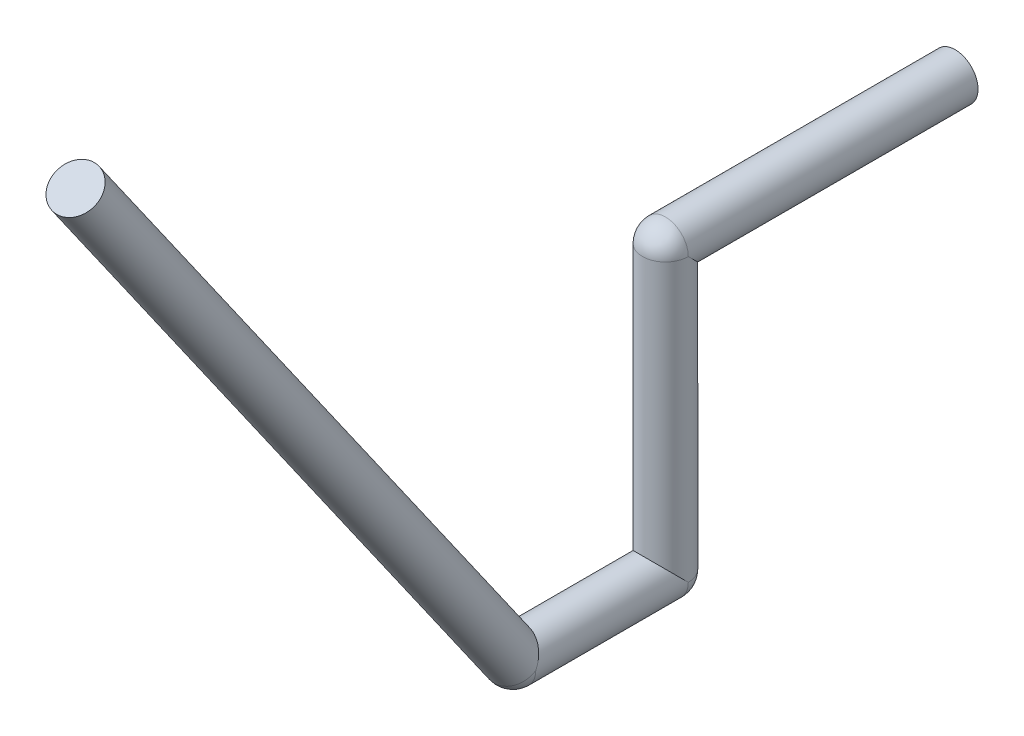
ISO-10303-21;
HEADER;
FILE_DESCRIPTION(('STEP AP214'),'2;1');
FILE_NAME('part.step','',(''),(''),'','','');
FILE_SCHEMA(('AUTOMOTIVE_DESIGN { 1 0 10303 214 1 1 1 1 }'));
ENDSEC;
DATA;
#1=APPLICATION_CONTEXT('core data for automotive mechanical design processes');
#2=APPLICATION_PROTOCOL_DEFINITION('international standard','automotive_design',2000,#1);
#3=PRODUCT_CONTEXT('',#1,'mechanical');
#4=PRODUCT('Part','Part','',(#3));
#5=PRODUCT_RELATED_PRODUCT_CATEGORY('part','',(#4));
#6=PRODUCT_DEFINITION_FORMATION('','',#4);
#7=PRODUCT_DEFINITION_CONTEXT('part definition',#1,'design');
#8=PRODUCT_DEFINITION('design','',#6,#7);
#9=PRODUCT_DEFINITION_SHAPE('','',#8);
#10=(LENGTH_UNIT() NAMED_UNIT(*) SI_UNIT(.MILLI.,.METRE.));
#11=(NAMED_UNIT(*) PLANE_ANGLE_UNIT() SI_UNIT($,.RADIAN.));
#12=(NAMED_UNIT(*) SI_UNIT($,.STERADIAN.) SOLID_ANGLE_UNIT());
#13=UNCERTAINTY_MEASURE_WITH_UNIT(LENGTH_MEASURE(1.E-05),#10,'distance_accuracy_value','');
#14=(GEOMETRIC_REPRESENTATION_CONTEXT(3) GLOBAL_UNCERTAINTY_ASSIGNED_CONTEXT((#13)) GLOBAL_UNIT_ASSIGNED_CONTEXT((#10,
#11,#12)) REPRESENTATION_CONTEXT('',''));
#15=CARTESIAN_POINT('',(0.,0.,0.));
#16=DIRECTION('',(0.,0.,1.));
#17=DIRECTION('',(1.,0.,0.));
#18=AXIS2_PLACEMENT_3D('',#15,#16,#17);
#19=CARTESIAN_POINT('',(1.8,12.49152044289,9.03576436351));
#20=DIRECTION('',(0.,0.819152044289016,0.573576436351011));
#21=DIRECTION('',(1.,0.,0.));
#22=AXIS2_PLACEMENT_3D('',#19,#20,#21);
#23=PLANE('',#22);
#24=CARTESIAN_POINT('',(1.8,12.49152044289,9.03576436351));
#25=DIRECTION('',(0.,0.819152044289016,0.573576436351011));
#26=DIRECTION('',(1.,0.,0.));
#27=AXIS2_PLACEMENT_3D('',#24,#25,#26);
#28=CIRCLE('',#27,0.3);
#29=CARTESIAN_POINT('',(1.5,12.49152044289,9.03576436351));
#30=VERTEX_POINT('',#29);
#31=EDGE_CURVE('E20',#30,#30,#28,.T.);
#32=ORIENTED_EDGE('',*,*,#31,.T.);
#33=EDGE_LOOP('',(#32));
#34=FACE_BOUND('',#33,.T.);
#35=ADVANCED_FACE('F17',(#34),#23,.T.);
#36=CARTESIAN_POINT('',(1.8,4.3,3.3));
#37=DIRECTION('',(0.,0.,1.));
#38=DIRECTION('',(1.,0.,0.));
#39=AXIS2_PLACEMENT_3D('',#36,#37,#38);
#40=SPHERICAL_SURFACE('',#39,0.3);
#41=CARTESIAN_POINT('',(1.8,4.3,3.3));
#42=DIRECTION('',(0.,0.,1.));
#43=DIRECTION('',(1.,0.,0.));
#44=AXIS2_PLACEMENT_3D('',#41,#42,#43);
#45=CIRCLE('',#44,0.3);
#46=CARTESIAN_POINT('',(1.5,4.3,3.3));
#47=VERTEX_POINT('',#46);
#48=CARTESIAN_POINT('',(2.1,4.3,3.3));
#49=VERTEX_POINT('',#48);
#50=EDGE_CURVE('E119',#47,#49,#45,.T.);
#51=ORIENTED_EDGE('',*,*,#50,.T.);
#52=CARTESIAN_POINT('',(1.8,4.3,3.3));
#53=DIRECTION('',(0.,0.819152044289016,0.573576436351011));
#54=DIRECTION('',(1.,0.,0.));
#55=AXIS2_PLACEMENT_3D('',#52,#53,#54);
#56=CIRCLE('',#55,0.3);
#57=EDGE_CURVE('E11',#47,#49,#56,.T.);
#58=ORIENTED_EDGE('',*,*,#57,.F.);
#59=EDGE_LOOP('',(#51,#58));
#60=FACE_BOUND('',#59,.T.);
#61=ADVANCED_FACE('F169',(#60),#40,.T.);
#62=CARTESIAN_POINT('',(1.8,4.3,3.3));
#63=DIRECTION('',(0.,0.819152044289016,0.573576436351011));
#64=DIRECTION('',(1.,0.,0.));
#65=AXIS2_PLACEMENT_3D('',#62,#63,#64);
#66=CYLINDRICAL_SURFACE('',#65,0.3);
#67=ORIENTED_EDGE('',*,*,#31,.F.);
#68=DIRECTION('',(0.,-0.819152044289016,-0.573576436351011));
#69=VECTOR('',#68,1.);
#70=CARTESIAN_POINT('',(1.5,4.3,3.3));
#71=LINE('',#70,#69);
#72=EDGE_CURVE('E27',#30,#47,#71,.T.);
#73=ORIENTED_EDGE('',*,*,#72,.T.);
#74=ORIENTED_EDGE('',*,*,#57,.T.);
#75=CARTESIAN_POINT('',(1.8,4.3,3.3));
#76=DIRECTION('',(0.,0.461748613235098,0.887010833178188));
#77=DIRECTION('',(0.,0.887010833178188,-0.461748613235098));
#78=AXIS2_PLACEMENT_3D('',#75,#76,#77);
#79=ELLIPSE('',#78,0.33821458406,0.3);
#80=EDGE_CURVE('E137',#49,#47,#79,.T.);
#81=ORIENTED_EDGE('',*,*,#80,.T.);
#82=ORIENTED_EDGE('',*,*,#72,.F.);
#83=EDGE_LOOP('',(#67,#73,#74,#81,#82));
#84=FACE_BOUND('',#83,.T.);
#85=ADVANCED_FACE('F162',(#84),#66,.T.);
#86=CARTESIAN_POINT('',(1.8,4.3,1.3));
#87=DIRECTION('',(0.577350269189626,0.577350269189626,0.577350269189626));
#88=DIRECTION('',(-0.707106781186548,0.,0.707106781186548));
#89=AXIS2_PLACEMENT_3D('',#86,#87,#88);
#90=SPHERICAL_SURFACE('',#89,0.3);
#91=CARTESIAN_POINT('',(1.8,4.3,1.3));
#92=DIRECTION('',(0.,-1.,0.));
#93=DIRECTION('',(1.,0.,0.));
#94=AXIS2_PLACEMENT_3D('',#91,#92,#93);
#95=CIRCLE('',#94,0.3);
#96=CARTESIAN_POINT('',(1.5,4.3,1.3));
#97=VERTEX_POINT('',#96);
#98=CARTESIAN_POINT('',(2.01213203435596,4.3,1.08786796564404));
#99=VERTEX_POINT('',#98);
#100=EDGE_CURVE('E89',#97,#99,#95,.T.);
#101=ORIENTED_EDGE('',*,*,#100,.T.);
#102=CARTESIAN_POINT('',(1.8,4.3,1.3));
#103=DIRECTION('',(-0.408248290463863,0.816496580927726,-0.408248290463863));
#104=DIRECTION('',(0.707106781186548,0.,-0.707106781186548));
#105=AXIS2_PLACEMENT_3D('',#102,#103,#104);
#106=CIRCLE('',#105,0.3);
#107=CARTESIAN_POINT('',(1.62679491924311,4.12679491924311,1.12679491924311));
#108=VERTEX_POINT('',#107);
#109=EDGE_CURVE('E134',#99,#108,#106,.T.);
#110=ORIENTED_EDGE('',*,*,#109,.T.);
#111=ORIENTED_EDGE('',*,*,#109,.F.);
#112=CARTESIAN_POINT('',(1.8,4.3,1.3));
#113=DIRECTION('',(0.,-1.,0.));
#114=DIRECTION('',(1.,0.,0.));
#115=AXIS2_PLACEMENT_3D('',#112,#113,#114);
#116=CIRCLE('',#115,0.3);
#117=CARTESIAN_POINT('',(2.1,4.3,1.3));
#118=VERTEX_POINT('',#117);
#119=EDGE_CURVE('E123',#99,#118,#116,.T.);
#120=ORIENTED_EDGE('',*,*,#119,.T.);
#121=CARTESIAN_POINT('',(1.8,4.3,1.3));
#122=DIRECTION('',(0.,0.,1.));
#123=DIRECTION('',(1.,0.,0.));
#124=AXIS2_PLACEMENT_3D('',#121,#122,#123);
#125=CIRCLE('',#124,0.3);
#126=EDGE_CURVE('E153',#97,#118,#125,.T.);
#127=ORIENTED_EDGE('',*,*,#126,.F.);
#128=EDGE_LOOP('',(#101,#110,#111,#120,#127));
#129=FACE_BOUND('',#128,.T.);
#130=ADVANCED_FACE('F237',(#129),#90,.T.);
#131=CARTESIAN_POINT('',(1.8,4.3,1.3));
#132=DIRECTION('',(0.,0.,1.));
#133=DIRECTION('',(1.,0.,0.));
#134=AXIS2_PLACEMENT_3D('',#131,#132,#133);
#135=CYLINDRICAL_SURFACE('',#134,0.3);
#136=ORIENTED_EDGE('',*,*,#50,.F.);
#137=DIRECTION('',(0.,0.,-1.));
#138=VECTOR('',#137,1.);
#139=CARTESIAN_POINT('',(1.5,4.3,1.3));
#140=LINE('',#139,#138);
#141=EDGE_CURVE('E113',#47,#97,#140,.T.);
#142=ORIENTED_EDGE('',*,*,#141,.T.);
#143=ORIENTED_EDGE('',*,*,#126,.T.);
#144=CARTESIAN_POINT('',(1.8,4.3,1.3));
#145=DIRECTION('',(0.,-0.707106781186548,0.707106781186548));
#146=DIRECTION('',(0.,-0.707106781186548,-0.707106781186548));
#147=AXIS2_PLACEMENT_3D('',#144,#145,#146);
#148=ELLIPSE('',#147,0.424264068712,0.3);
#149=EDGE_CURVE('E127',#118,#97,#148,.T.);
#150=ORIENTED_EDGE('',*,*,#149,.T.);
#151=ORIENTED_EDGE('',*,*,#141,.F.);
#152=ORIENTED_EDGE('',*,*,#80,.F.);
#153=EDGE_LOOP('',(#136,#142,#143,#150,#151,#152));
#154=FACE_BOUND('',#153,.T.);
#155=ADVANCED_FACE('F166',(#154),#135,.T.);
#156=CARTESIAN_POINT('',(1.8,8.,1.3));
#157=DIRECTION('',(0.,-1.,0.));
#158=DIRECTION('',(1.,0.,0.));
#159=AXIS2_PLACEMENT_3D('',#156,#157,#158);
#160=CYLINDRICAL_SURFACE('',#159,0.3);
#161=ORIENTED_EDGE('',*,*,#100,.F.);
#162=DIRECTION('',(0.,1.,0.));
#163=VECTOR('',#162,1.);
#164=CARTESIAN_POINT('',(1.5,8.,1.3));
#165=LINE('',#164,#163);
#166=CARTESIAN_POINT('',(1.5,8.,1.3));
#167=VERTEX_POINT('',#166);
#168=EDGE_CURVE('E118',#97,#167,#165,.T.);
#169=ORIENTED_EDGE('',*,*,#168,.T.);
#170=CARTESIAN_POINT('',(1.8,8.,1.3));
#171=DIRECTION('',(0.,-0.707106781186548,0.707106781186548));
#172=DIRECTION('',(0.,0.707106781186548,0.707106781186548));
#173=AXIS2_PLACEMENT_3D('',#170,#171,#172);
#174=ELLIPSE('',#173,0.424264068712,0.3);
#175=CARTESIAN_POINT('',(2.1,8.,1.3));
#176=VERTEX_POINT('',#175);
#177=EDGE_CURVE('E109',#167,#176,#174,.T.);
#178=ORIENTED_EDGE('',*,*,#177,.T.);
#179=CARTESIAN_POINT('',(1.8,8.,1.3));
#180=DIRECTION('',(0.,-1.,0.));
#181=DIRECTION('',(1.,0.,0.));
#182=AXIS2_PLACEMENT_3D('',#179,#180,#181);
#183=CIRCLE('',#182,0.3);
#184=EDGE_CURVE('E90',#176,#167,#183,.T.);
#185=ORIENTED_EDGE('',*,*,#184,.T.);
#186=ORIENTED_EDGE('',*,*,#168,.F.);
#187=ORIENTED_EDGE('',*,*,#149,.F.);
#188=ORIENTED_EDGE('',*,*,#119,.F.);
#189=EDGE_LOOP('',(#161,#169,#178,#185,#186,#187,#188));
#190=FACE_BOUND('',#189,.T.);
#191=ADVANCED_FACE('F145',(#190),#160,.T.);
#192=CARTESIAN_POINT('',(1.8,8.,1.3));
#193=DIRECTION('',(0.577350269189625,0.577350269189628,0.577350269189625));
#194=DIRECTION('',(-0.707106781186548,0.,0.707106781186548));
#195=AXIS2_PLACEMENT_3D('',#192,#193,#194);
#196=SPHERICAL_SURFACE('',#195,0.3);
#197=ORIENTED_EDGE('',*,*,#184,.F.);
#198=CARTESIAN_POINT('',(1.8,8.,1.3));
#199=DIRECTION('',(0.,0.,1.));
#200=DIRECTION('',(1.,0.,0.));
#201=AXIS2_PLACEMENT_3D('',#198,#199,#200);
#202=CIRCLE('',#201,0.3);
#203=CARTESIAN_POINT('',(2.06832815729997,8.13416407864999,1.3));
#204=VERTEX_POINT('',#203);
#205=EDGE_CURVE('E93',#176,#204,#202,.T.);
#206=ORIENTED_EDGE('',*,*,#205,.T.);
#207=CARTESIAN_POINT('',(1.8,8.,1.3));
#208=DIRECTION('',(-0.408248290463863,0.816496580927726,-0.408248290463863));
#209=DIRECTION('',(0.707106781186548,0.,-0.707106781186548));
#210=AXIS2_PLACEMENT_3D('',#207,#208,#209);
#211=CIRCLE('',#210,0.3);
#212=CARTESIAN_POINT('',(1.97320508075689,8.17320508075689,1.47320508075689));
#213=VERTEX_POINT('',#212);
#214=EDGE_CURVE('E82',#213,#204,#211,.T.);
#215=ORIENTED_EDGE('',*,*,#214,.F.);
#216=ORIENTED_EDGE('',*,*,#214,.T.);
#217=CARTESIAN_POINT('',(1.8,8.,1.3));
#218=DIRECTION('',(0.,0.,1.));
#219=DIRECTION('',(1.,0.,0.));
#220=AXIS2_PLACEMENT_3D('',#217,#218,#219);
#221=CIRCLE('',#220,0.3);
#222=EDGE_CURVE('E86',#204,#167,#221,.T.);
#223=ORIENTED_EDGE('',*,*,#222,.T.);
#224=EDGE_LOOP('',(#197,#206,#215,#216,#223));
#225=FACE_BOUND('',#224,.T.);
#226=ADVANCED_FACE('F84',(#225),#196,.T.);
#227=CARTESIAN_POINT('',(1.8,8.,-2.5));
#228=DIRECTION('',(0.,0.,1.));
#229=DIRECTION('',(1.,0.,0.));
#230=AXIS2_PLACEMENT_3D('',#227,#228,#229);
#231=CYLINDRICAL_SURFACE('',#230,0.3);
#232=ORIENTED_EDGE('',*,*,#177,.F.);
#233=DIRECTION('',(0.,0.,-1.));
#234=VECTOR('',#233,1.);
#235=CARTESIAN_POINT('',(1.5,8.,-2.5));
#236=LINE('',#235,#234);
#237=CARTESIAN_POINT('',(1.5,8.,-2.5));
#238=VERTEX_POINT('',#237);
#239=EDGE_CURVE('E102',#167,#238,#236,.T.);
#240=ORIENTED_EDGE('',*,*,#239,.T.);
#241=CARTESIAN_POINT('',(1.8,8.,-2.5));
#242=DIRECTION('',(0.,0.,1.));
#243=DIRECTION('',(1.,0.,0.));
#244=AXIS2_PLACEMENT_3D('',#241,#242,#243);
#245=CIRCLE('',#244,0.3);
#246=EDGE_CURVE('E129',#238,#238,#245,.T.);
#247=ORIENTED_EDGE('',*,*,#246,.T.);
#248=ORIENTED_EDGE('',*,*,#239,.F.);
#249=ORIENTED_EDGE('',*,*,#222,.F.);
#250=ORIENTED_EDGE('',*,*,#205,.F.);
#251=EDGE_LOOP('',(#232,#240,#247,#248,#249,#250));
#252=FACE_BOUND('',#251,.T.);
#253=ADVANCED_FACE('F100',(#252),#231,.T.);
#254=CARTESIAN_POINT('',(1.8,8.,-2.5));
#255=DIRECTION('',(0.,0.,1.));
#256=DIRECTION('',(1.,0.,0.));
#257=AXIS2_PLACEMENT_3D('',#254,#255,#256);
#258=PLANE('',#257);
#259=ORIENTED_EDGE('',*,*,#246,.F.);
#260=EDGE_LOOP('',(#259));
#261=FACE_BOUND('',#260,.T.);
#262=ADVANCED_FACE('F195',(#261),#258,.F.);
#263=CLOSED_SHELL('',(#35,#61,#85,#130,#155,#191,#226,#253,#262));
#264=MANIFOLD_SOLID_BREP('B1',#263);
#265=ADVANCED_BREP_SHAPE_REPRESENTATION('',(#18,#264),#14);
#266=SHAPE_DEFINITION_REPRESENTATION(#9,#265);
ENDSEC;
END-ISO-10303-21;
